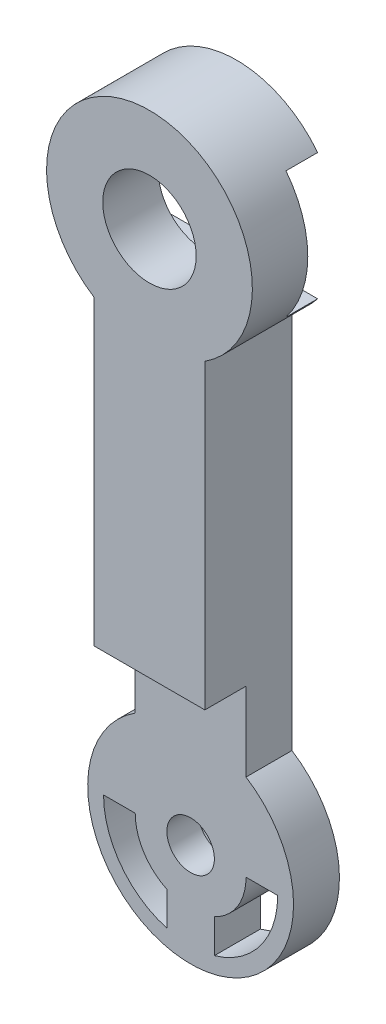
ISO-10303-21;
HEADER;
FILE_DESCRIPTION(('STEP AP214'),'2;1');
FILE_NAME('part.step','',(''),(''),'','','');
FILE_SCHEMA(('AUTOMOTIVE_DESIGN { 1 0 10303 214 1 1 1 1 }'));
ENDSEC;
DATA;
#1=APPLICATION_CONTEXT('core data for automotive mechanical design processes');
#2=APPLICATION_PROTOCOL_DEFINITION('international standard','automotive_design',2000,#1);
#3=PRODUCT_CONTEXT('',#1,'mechanical');
#4=PRODUCT('Part','Part','',(#3));
#5=PRODUCT_RELATED_PRODUCT_CATEGORY('part','',(#4));
#6=PRODUCT_DEFINITION_FORMATION('','',#4);
#7=PRODUCT_DEFINITION_CONTEXT('part definition',#1,'design');
#8=PRODUCT_DEFINITION('design','',#6,#7);
#9=PRODUCT_DEFINITION_SHAPE('','',#8);
#10=(LENGTH_UNIT() NAMED_UNIT(*) SI_UNIT(.MILLI.,.METRE.));
#11=(NAMED_UNIT(*) PLANE_ANGLE_UNIT() SI_UNIT($,.RADIAN.));
#12=(NAMED_UNIT(*) SI_UNIT($,.STERADIAN.) SOLID_ANGLE_UNIT());
#13=UNCERTAINTY_MEASURE_WITH_UNIT(LENGTH_MEASURE(1.E-05),#10,'distance_accuracy_value','');
#14=(GEOMETRIC_REPRESENTATION_CONTEXT(3) GLOBAL_UNCERTAINTY_ASSIGNED_CONTEXT((#13)) GLOBAL_UNIT_ASSIGNED_CONTEXT((#10,
#11,#12)) REPRESENTATION_CONTEXT('',''));
#15=CARTESIAN_POINT('',(0.,0.,0.));
#16=DIRECTION('',(0.,0.,1.));
#17=DIRECTION('',(1.,0.,0.));
#18=AXIS2_PLACEMENT_3D('',#15,#16,#17);
#19=CARTESIAN_POINT('',(0.,0.,3.7));
#20=DIRECTION('',(0.,0.,-1.));
#21=DIRECTION('',(-1.,0.,0.));
#22=AXIS2_PLACEMENT_3D('',#19,#20,#21);
#23=CYLINDRICAL_SURFACE('',#22,2.95);
#24=CARTESIAN_POINT('',(0.,0.,6.1));
#25=DIRECTION('',(0.,0.,1.));
#26=DIRECTION('',(1.,0.,0.));
#27=AXIS2_PLACEMENT_3D('',#24,#25,#26);
#28=CIRCLE('',#27,2.95);
#29=CARTESIAN_POINT('',(2.95,0.,6.1));
#30=VERTEX_POINT('',#29);
#31=EDGE_CURVE('E269',#30,#30,#28,.T.);
#32=ORIENTED_EDGE('',*,*,#31,.T.);
#33=EDGE_LOOP('',(#32));
#34=FACE_BOUND('',#33,.T.);
#35=CARTESIAN_POINT('',(0.,0.,2.6));
#36=DIRECTION('',(0.,0.,-1.));
#37=DIRECTION('',(-1.,0.,0.));
#38=AXIS2_PLACEMENT_3D('',#35,#36,#37);
#39=CIRCLE('',#38,2.95);
#40=CARTESIAN_POINT('',(-2.95,0.,2.6));
#41=VERTEX_POINT('',#40);
#42=EDGE_CURVE('E186',#41,#41,#39,.F.);
#43=ORIENTED_EDGE('',*,*,#42,.F.);
#44=EDGE_LOOP('',(#43));
#45=FACE_BOUND('',#44,.T.);
#46=ADVANCED_FACE('F47',(#34,#45),#23,.F.);
#47=CARTESIAN_POINT('',(0.,0.,0.6));
#48=DIRECTION('',(0.,0.,-1.));
#49=DIRECTION('',(-1.,0.,0.));
#50=AXIS2_PLACEMENT_3D('',#47,#48,#49);
#51=PLANE('',#50);
#52=CARTESIAN_POINT('',(0.,0.,0.6));
#53=DIRECTION('',(0.,0.,-1.));
#54=DIRECTION('',(-1.,0.,0.));
#55=AXIS2_PLACEMENT_3D('',#52,#53,#54);
#56=CIRCLE('',#55,6.5);
#57=CARTESIAN_POINT('',(-5.1234753829798,4.,0.6));
#58=VERTEX_POINT('',#57);
#59=CARTESIAN_POINT('',(5.1234753829798,4.,0.6));
#60=VERTEX_POINT('',#59);
#61=EDGE_CURVE('E231',#58,#60,#56,.T.);
#62=ORIENTED_EDGE('',*,*,#61,.T.);
#63=DIRECTION('',(-1.,0.,0.));
#64=VECTOR('',#63,1.);
#65=CARTESIAN_POINT('',(0.,4.,0.6));
#66=LINE('',#65,#64);
#67=EDGE_CURVE('E198',#60,#58,#66,.T.);
#68=ORIENTED_EDGE('',*,*,#67,.T.);
#69=EDGE_LOOP('',(#62,#68));
#70=FACE_BOUND('',#69,.T.);
#71=ADVANCED_FACE('F420',(#70),#51,.T.);
#72=CARTESIAN_POINT('',(-3.5,0.,3.7));
#73=DIRECTION('',(1.,0.,0.));
#74=DIRECTION('',(0.,1.,0.));
#75=AXIS2_PLACEMENT_3D('',#72,#73,#74);
#76=PLANE('',#75);
#77=DIRECTION('',(0.,1.,0.));
#78=VECTOR('',#77,1.);
#79=CARTESIAN_POINT('',(-3.5,0.,0.6));
#80=LINE('',#79,#78);
#81=CARTESIAN_POINT('',(-3.5,-29.5227744249483,0.6));
#82=VERTEX_POINT('',#81);
#83=CARTESIAN_POINT('',(-3.5,-5.47722557505166,0.6));
#84=VERTEX_POINT('',#83);
#85=EDGE_CURVE('E240',#82,#84,#80,.T.);
#86=ORIENTED_EDGE('',*,*,#85,.F.);
#87=DIRECTION('',(0.,0.,-1.));
#88=VECTOR('',#87,1.);
#89=CARTESIAN_POINT('',(-3.5,-29.5227744249483,3.7));
#90=LINE('',#89,#88);
#91=CARTESIAN_POINT('',(-3.5,-29.5227744249483,3.5));
#92=VERTEX_POINT('',#91);
#93=EDGE_CURVE('E57',#92,#82,#90,.T.);
#94=ORIENTED_EDGE('',*,*,#93,.F.);
#95=DIRECTION('',(0.,-1.,0.));
#96=VECTOR('',#95,1.);
#97=CARTESIAN_POINT('',(-3.5,0.,3.5));
#98=LINE('',#97,#96);
#99=CARTESIAN_POINT('',(-3.5,-24.55,3.5));
#100=VERTEX_POINT('',#99);
#101=EDGE_CURVE('E306',#100,#92,#98,.T.);
#102=ORIENTED_EDGE('',*,*,#101,.F.);
#103=DIRECTION('',(0.,0.,-1.));
#104=VECTOR('',#103,1.);
#105=CARTESIAN_POINT('',(-3.5,-24.55,3.7));
#106=LINE('',#105,#104);
#107=CARTESIAN_POINT('',(-3.5,-24.55,6.1));
#108=VERTEX_POINT('',#107);
#109=EDGE_CURVE('E344',#108,#100,#106,.T.);
#110=ORIENTED_EDGE('',*,*,#109,.F.);
#111=DIRECTION('',(0.,-1.,0.));
#112=VECTOR('',#111,1.);
#113=CARTESIAN_POINT('',(-3.5,-5.47722557505166,6.1));
#114=LINE('',#113,#112);
#115=CARTESIAN_POINT('',(-3.5,-5.47722557505166,6.1));
#116=VERTEX_POINT('',#115);
#117=EDGE_CURVE('E277',#116,#108,#114,.T.);
#118=ORIENTED_EDGE('',*,*,#117,.F.);
#119=DIRECTION('',(0.,0.,-1.));
#120=VECTOR('',#119,1.);
#121=CARTESIAN_POINT('',(-3.5,-5.47722557505166,3.7));
#122=LINE('',#121,#120);
#123=EDGE_CURVE('E11',#116,#84,#122,.T.);
#124=ORIENTED_EDGE('',*,*,#123,.T.);
#125=EDGE_LOOP('',(#86,#94,#102,#110,#118,#124));
#126=FACE_BOUND('',#125,.T.);
#127=ADVANCED_FACE('F426',(#126),#76,.F.);
#128=CARTESIAN_POINT('',(0.,-35.,3.7));
#129=DIRECTION('',(0.,0.,-1.));
#130=DIRECTION('',(-1.,0.,0.));
#131=AXIS2_PLACEMENT_3D('',#128,#129,#130);
#132=CYLINDRICAL_SURFACE('',#131,6.5);
#133=ORIENTED_EDGE('',*,*,#93,.T.);
#134=CARTESIAN_POINT('',(0.,-35.,0.6));
#135=DIRECTION('',(0.,0.,-1.));
#136=DIRECTION('',(-1.,0.,0.));
#137=AXIS2_PLACEMENT_3D('',#134,#135,#136);
#138=CIRCLE('',#137,6.5);
#139=CARTESIAN_POINT('',(3.5,-29.5227744249483,0.6));
#140=VERTEX_POINT('',#139);
#141=EDGE_CURVE('E236',#82,#140,#138,.F.);
#142=ORIENTED_EDGE('',*,*,#141,.T.);
#143=DIRECTION('',(0.,0.,-1.));
#144=VECTOR('',#143,1.);
#145=CARTESIAN_POINT('',(3.5,-29.5227744249483,3.7));
#146=LINE('',#145,#144);
#147=CARTESIAN_POINT('',(3.5,-29.5227744249483,3.5));
#148=VERTEX_POINT('',#147);
#149=EDGE_CURVE('E352',#148,#140,#146,.T.);
#150=ORIENTED_EDGE('',*,*,#149,.F.);
#151=CARTESIAN_POINT('',(0.,-35.,3.5));
#152=DIRECTION('',(0.,0.,1.));
#153=DIRECTION('',(1.,0.,0.));
#154=AXIS2_PLACEMENT_3D('',#151,#152,#153);
#155=CIRCLE('',#154,6.5);
#156=EDGE_CURVE('E311',#92,#148,#155,.T.);
#157=ORIENTED_EDGE('',*,*,#156,.F.);
#158=EDGE_LOOP('',(#133,#142,#150,#157));
#159=FACE_BOUND('',#158,.T.);
#160=ADVANCED_FACE('F473',(#159),#132,.T.);
#161=CARTESIAN_POINT('',(0.,-35.,3.7));
#162=DIRECTION('',(0.,-1.,0.));
#163=DIRECTION('',(0.,0.,-1.));
#164=AXIS2_PLACEMENT_3D('',#161,#162,#163);
#165=PLANE('',#164);
#166=DIRECTION('',(0.,0.,-1.));
#167=VECTOR('',#166,1.);
#168=CARTESIAN_POINT('',(-5.5,-35.,3.7));
#169=LINE('',#168,#167);
#170=CARTESIAN_POINT('',(-5.5,-35.,3.5));
#171=VERTEX_POINT('',#170);
#172=CARTESIAN_POINT('',(-5.5,-35.,0.6));
#173=VERTEX_POINT('',#172);
#174=EDGE_CURVE('E360',#171,#173,#169,.T.);
#175=ORIENTED_EDGE('',*,*,#174,.T.);
#176=DIRECTION('',(1.,0.,0.));
#177=VECTOR('',#176,1.);
#178=CARTESIAN_POINT('',(0.,-35.,0.6));
#179=LINE('',#178,#177);
#180=CARTESIAN_POINT('',(-3.5,-35.,0.6));
#181=VERTEX_POINT('',#180);
#182=EDGE_CURVE('E73',#173,#181,#179,.T.);
#183=ORIENTED_EDGE('',*,*,#182,.T.);
#184=DIRECTION('',(0.,0.,-1.));
#185=VECTOR('',#184,1.);
#186=CARTESIAN_POINT('',(-3.5,-35.,3.7));
#187=LINE('',#186,#185);
#188=CARTESIAN_POINT('',(-3.5,-35.,3.5));
#189=VERTEX_POINT('',#188);
#190=EDGE_CURVE('E353',#189,#181,#187,.T.);
#191=ORIENTED_EDGE('',*,*,#190,.F.);
#192=DIRECTION('',(1.,0.,0.));
#193=VECTOR('',#192,1.);
#194=CARTESIAN_POINT('',(0.,-35.,3.5));
#195=LINE('',#194,#193);
#196=EDGE_CURVE('E323',#171,#189,#195,.T.);
#197=ORIENTED_EDGE('',*,*,#196,.F.);
#198=EDGE_LOOP('',(#175,#183,#191,#197));
#199=FACE_BOUND('',#198,.T.);
#200=ADVANCED_FACE('F431',(#199),#165,.T.);
#201=CARTESIAN_POINT('',(0.,-35.,3.7));
#202=DIRECTION('',(0.,0.,-1.));
#203=DIRECTION('',(-1.,0.,0.));
#204=AXIS2_PLACEMENT_3D('',#201,#202,#203);
#205=CYLINDRICAL_SURFACE('',#204,3.5);
#206=ORIENTED_EDGE('',*,*,#190,.T.);
#207=CARTESIAN_POINT('',(0.,-35.,0.6));
#208=DIRECTION('',(0.,0.,-1.));
#209=DIRECTION('',(-1.,0.,0.));
#210=AXIS2_PLACEMENT_3D('',#207,#208,#209);
#211=CIRCLE('',#210,3.5);
#212=CARTESIAN_POINT('',(-1.5,-38.1622776601684,0.6));
#213=VERTEX_POINT('',#212);
#214=EDGE_CURVE('E263',#181,#213,#211,.F.);
#215=ORIENTED_EDGE('',*,*,#214,.T.);
#216=DIRECTION('',(0.,0.,-1.));
#217=VECTOR('',#216,1.);
#218=CARTESIAN_POINT('',(-1.5,-38.1622776601684,3.7));
#219=LINE('',#218,#217);
#220=CARTESIAN_POINT('',(-1.5,-38.1622776601684,3.5));
#221=VERTEX_POINT('',#220);
#222=EDGE_CURVE('E369',#221,#213,#219,.T.);
#223=ORIENTED_EDGE('',*,*,#222,.F.);
#224=CARTESIAN_POINT('',(0.,-35.,3.5));
#225=DIRECTION('',(0.,0.,1.));
#226=DIRECTION('',(1.,0.,0.));
#227=AXIS2_PLACEMENT_3D('',#224,#225,#226);
#228=CIRCLE('',#227,3.5);
#229=EDGE_CURVE('E298',#189,#221,#228,.T.);
#230=ORIENTED_EDGE('',*,*,#229,.F.);
#231=EDGE_LOOP('',(#206,#215,#223,#230));
#232=FACE_BOUND('',#231,.T.);
#233=ADVANCED_FACE('F461',(#232),#205,.T.);
#234=CARTESIAN_POINT('',(-1.5,0.,3.7));
#235=DIRECTION('',(1.,0.,0.));
#236=DIRECTION('',(0.,0.,-1.));
#237=AXIS2_PLACEMENT_3D('',#234,#235,#236);
#238=PLANE('',#237);
#239=DIRECTION('',(0.,1.,0.));
#240=VECTOR('',#239,1.);
#241=CARTESIAN_POINT('',(-1.5,0.,0.6));
#242=LINE('',#241,#240);
#243=CARTESIAN_POINT('',(-1.5,-40.2915026221292,0.6));
#244=VERTEX_POINT('',#243);
#245=EDGE_CURVE('E260',#244,#213,#242,.T.);
#246=ORIENTED_EDGE('',*,*,#245,.F.);
#247=DIRECTION('',(0.,0.,-1.));
#248=VECTOR('',#247,1.);
#249=CARTESIAN_POINT('',(-1.5,-40.2915026221292,3.7));
#250=LINE('',#249,#248);
#251=CARTESIAN_POINT('',(-1.5,-40.2915026221292,3.5));
#252=VERTEX_POINT('',#251);
#253=EDGE_CURVE('E364',#252,#244,#250,.T.);
#254=ORIENTED_EDGE('',*,*,#253,.F.);
#255=DIRECTION('',(0.,-1.,0.));
#256=VECTOR('',#255,1.);
#257=CARTESIAN_POINT('',(-1.5,0.,3.5));
#258=LINE('',#257,#256);
#259=EDGE_CURVE('E327',#221,#252,#258,.T.);
#260=ORIENTED_EDGE('',*,*,#259,.F.);
#261=ORIENTED_EDGE('',*,*,#222,.T.);
#262=EDGE_LOOP('',(#246,#254,#260,#261));
#263=FACE_BOUND('',#262,.T.);
#264=ADVANCED_FACE('F460',(#263),#238,.F.);
#265=DIRECTION('',(0.,0.,-1.));
#266=VECTOR('',#265,1.);
#267=CARTESIAN_POINT('',(1.5,-38.1622776601684,3.7));
#268=LINE('',#267,#266);
#269=CARTESIAN_POINT('',(1.5,-38.1622776601684,3.5));
#270=VERTEX_POINT('',#269);
#271=CARTESIAN_POINT('',(1.5,-38.1622776601684,0.6));
#272=VERTEX_POINT('',#271);
#273=EDGE_CURVE('E347',#270,#272,#268,.T.);
#274=ORIENTED_EDGE('',*,*,#273,.T.);
#275=CARTESIAN_POINT('',(0.,-35.,0.6));
#276=DIRECTION('',(0.,0.,-1.));
#277=DIRECTION('',(-1.,0.,0.));
#278=AXIS2_PLACEMENT_3D('',#275,#276,#277);
#279=CIRCLE('',#278,3.5);
#280=CARTESIAN_POINT('',(3.5,-35.,0.6));
#281=VERTEX_POINT('',#280);
#282=EDGE_CURVE('E253',#272,#281,#279,.F.);
#283=ORIENTED_EDGE('',*,*,#282,.T.);
#284=DIRECTION('',(0.,0.,-1.));
#285=VECTOR('',#284,1.);
#286=CARTESIAN_POINT('',(3.5,-35.,3.7));
#287=LINE('',#286,#285);
#288=CARTESIAN_POINT('',(3.5,-35.,3.5));
#289=VERTEX_POINT('',#288);
#290=EDGE_CURVE('E365',#289,#281,#287,.T.);
#291=ORIENTED_EDGE('',*,*,#290,.F.);
#292=EDGE_CURVE('E293',#270,#289,#228,.T.);
#293=ORIENTED_EDGE('',*,*,#292,.F.);
#294=EDGE_LOOP('',(#274,#283,#291,#293));
#295=FACE_BOUND('',#294,.T.);
#296=ADVANCED_FACE('F458',(#295),#205,.T.);
#297=CARTESIAN_POINT('',(0.,-35.,3.7));
#298=DIRECTION('',(0.,1.,0.));
#299=DIRECTION('',(0.,0.,1.));
#300=AXIS2_PLACEMENT_3D('',#297,#298,#299);
#301=PLANE('',#300);
#302=DIRECTION('',(-1.,0.,0.));
#303=VECTOR('',#302,1.);
#304=CARTESIAN_POINT('',(0.,-35.,0.6));
#305=LINE('',#304,#303);
#306=CARTESIAN_POINT('',(5.5,-35.,0.6));
#307=VERTEX_POINT('',#306);
#308=EDGE_CURVE('E250',#307,#281,#305,.T.);
#309=ORIENTED_EDGE('',*,*,#308,.F.);
#310=DIRECTION('',(0.,0.,-1.));
#311=VECTOR('',#310,1.);
#312=CARTESIAN_POINT('',(5.5,-35.,3.7));
#313=LINE('',#312,#311);
#314=CARTESIAN_POINT('',(5.5,-35.,3.5));
#315=VERTEX_POINT('',#314);
#316=EDGE_CURVE('E383',#315,#307,#313,.T.);
#317=ORIENTED_EDGE('',*,*,#316,.F.);
#318=DIRECTION('',(1.,0.,0.));
#319=VECTOR('',#318,1.);
#320=CARTESIAN_POINT('',(0.,-35.,3.5));
#321=LINE('',#320,#319);
#322=EDGE_CURVE('E297',#289,#315,#321,.T.);
#323=ORIENTED_EDGE('',*,*,#322,.F.);
#324=ORIENTED_EDGE('',*,*,#290,.T.);
#325=EDGE_LOOP('',(#309,#317,#323,#324));
#326=FACE_BOUND('',#325,.T.);
#327=ADVANCED_FACE('F49',(#326),#301,.F.);
#328=CARTESIAN_POINT('',(0.,-35.,3.7));
#329=DIRECTION('',(0.,0.,-1.));
#330=DIRECTION('',(-1.,0.,0.));
#331=AXIS2_PLACEMENT_3D('',#328,#329,#330);
#332=CYLINDRICAL_SURFACE('',#331,5.5);
#333=CARTESIAN_POINT('',(0.,-35.,0.6));
#334=DIRECTION('',(0.,0.,-1.));
#335=DIRECTION('',(-1.,0.,0.));
#336=AXIS2_PLACEMENT_3D('',#333,#334,#335);
#337=CIRCLE('',#336,5.5);
#338=CARTESIAN_POINT('',(1.5,-40.2915026221292,0.6));
#339=VERTEX_POINT('',#338);
#340=EDGE_CURVE('E247',#339,#307,#337,.F.);
#341=ORIENTED_EDGE('',*,*,#340,.F.);
#342=DIRECTION('',(0.,0.,-1.));
#343=VECTOR('',#342,1.);
#344=CARTESIAN_POINT('',(1.5,-40.2915026221292,3.7));
#345=LINE('',#344,#343);
#346=CARTESIAN_POINT('',(1.5,-40.2915026221292,3.5));
#347=VERTEX_POINT('',#346);
#348=EDGE_CURVE('E379',#347,#339,#345,.T.);
#349=ORIENTED_EDGE('',*,*,#348,.F.);
#350=CARTESIAN_POINT('',(0.,-35.,3.5));
#351=DIRECTION('',(0.,0.,1.));
#352=DIRECTION('',(1.,0.,0.));
#353=AXIS2_PLACEMENT_3D('',#350,#351,#352);
#354=CIRCLE('',#353,5.5);
#355=EDGE_CURVE('E302',#347,#315,#354,.T.);
#356=ORIENTED_EDGE('',*,*,#355,.T.);
#357=ORIENTED_EDGE('',*,*,#316,.T.);
#358=EDGE_LOOP('',(#341,#349,#356,#357));
#359=FACE_BOUND('',#358,.T.);
#360=ADVANCED_FACE('F446',(#359),#332,.F.);
#361=CARTESIAN_POINT('',(3.5,0.,3.7));
#362=DIRECTION('',(1.,0.,0.));
#363=DIRECTION('',(0.,1.,0.));
#364=AXIS2_PLACEMENT_3D('',#361,#362,#363);
#365=PLANE('',#364);
#366=ORIENTED_EDGE('',*,*,#149,.T.);
#367=DIRECTION('',(0.,1.,0.));
#368=VECTOR('',#367,1.);
#369=CARTESIAN_POINT('',(3.5,0.,0.6));
#370=LINE('',#369,#368);
#371=CARTESIAN_POINT('',(3.5,-5.47722557505166,0.6));
#372=VERTEX_POINT('',#371);
#373=EDGE_CURVE('E230',#140,#372,#370,.T.);
#374=ORIENTED_EDGE('',*,*,#373,.T.);
#375=DIRECTION('',(0.,0.,-1.));
#376=VECTOR('',#375,1.);
#377=CARTESIAN_POINT('',(3.5,-5.47722557505166,3.7));
#378=LINE('',#377,#376);
#379=CARTESIAN_POINT('',(3.5,-5.47722557505166,6.1));
#380=VERTEX_POINT('',#379);
#381=EDGE_CURVE('E348',#380,#372,#378,.T.);
#382=ORIENTED_EDGE('',*,*,#381,.F.);
#383=DIRECTION('',(0.,1.,0.));
#384=VECTOR('',#383,1.);
#385=CARTESIAN_POINT('',(3.5,-5.47722557505166,6.1));
#386=LINE('',#385,#384);
#387=CARTESIAN_POINT('',(3.5,-24.55,6.1));
#388=VERTEX_POINT('',#387);
#389=EDGE_CURVE('E285',#388,#380,#386,.T.);
#390=ORIENTED_EDGE('',*,*,#389,.F.);
#391=DIRECTION('',(0.,0.,-1.));
#392=VECTOR('',#391,1.);
#393=CARTESIAN_POINT('',(3.5,-24.55,3.7));
#394=LINE('',#393,#392);
#395=CARTESIAN_POINT('',(3.5,-24.55,3.5));
#396=VERTEX_POINT('',#395);
#397=EDGE_CURVE('E340',#388,#396,#394,.T.);
#398=ORIENTED_EDGE('',*,*,#397,.T.);
#399=DIRECTION('',(0.,1.,0.));
#400=VECTOR('',#399,1.);
#401=CARTESIAN_POINT('',(3.5,0.,3.5));
#402=LINE('',#401,#400);
#403=EDGE_CURVE('E315',#148,#396,#402,.T.);
#404=ORIENTED_EDGE('',*,*,#403,.F.);
#405=EDGE_LOOP('',(#366,#374,#382,#390,#398,#404));
#406=FACE_BOUND('',#405,.T.);
#407=ADVANCED_FACE('F443',(#406),#365,.T.);
#408=CARTESIAN_POINT('',(0.,-35.,0.6));
#409=DIRECTION('',(0.,0.,-1.));
#410=DIRECTION('',(-1.,0.,0.));
#411=AXIS2_PLACEMENT_3D('',#408,#409,#410);
#412=CIRCLE('',#411,5.5);
#413=EDGE_CURVE('E257',#173,#244,#412,.F.);
#414=ORIENTED_EDGE('',*,*,#413,.F.);
#415=ORIENTED_EDGE('',*,*,#174,.F.);
#416=EDGE_CURVE('E307',#171,#252,#354,.T.);
#417=ORIENTED_EDGE('',*,*,#416,.T.);
#418=ORIENTED_EDGE('',*,*,#253,.T.);
#419=EDGE_LOOP('',(#414,#415,#417,#418));
#420=FACE_BOUND('',#419,.T.);
#421=ADVANCED_FACE('F435',(#420),#332,.F.);
#422=CARTESIAN_POINT('',(1.5,0.,3.7));
#423=DIRECTION('',(1.,0.,0.));
#424=DIRECTION('',(0.,0.,-1.));
#425=AXIS2_PLACEMENT_3D('',#422,#423,#424);
#426=PLANE('',#425);
#427=ORIENTED_EDGE('',*,*,#348,.T.);
#428=DIRECTION('',(0.,1.,0.));
#429=VECTOR('',#428,1.);
#430=CARTESIAN_POINT('',(1.5,0.,0.6));
#431=LINE('',#430,#429);
#432=EDGE_CURVE('E243',#339,#272,#431,.T.);
#433=ORIENTED_EDGE('',*,*,#432,.T.);
#434=ORIENTED_EDGE('',*,*,#273,.F.);
#435=DIRECTION('',(0.,1.,0.));
#436=VECTOR('',#435,1.);
#437=CARTESIAN_POINT('',(1.5,0.,3.5));
#438=LINE('',#437,#436);
#439=EDGE_CURVE('E289',#347,#270,#438,.T.);
#440=ORIENTED_EDGE('',*,*,#439,.F.);
#441=EDGE_LOOP('',(#427,#433,#434,#440));
#442=FACE_BOUND('',#441,.T.);
#443=ADVANCED_FACE('F433',(#442),#426,.T.);
#444=CARTESIAN_POINT('',(0.,0.,3.7));
#445=DIRECTION('',(0.,0.,-1.));
#446=DIRECTION('',(-1.,0.,0.));
#447=AXIS2_PLACEMENT_3D('',#444,#445,#446);
#448=CYLINDRICAL_SURFACE('',#447,6.5);
#449=CARTESIAN_POINT('',(5.1234753829798,-4.,0.6));
#450=VERTEX_POINT('',#449);
#451=EDGE_CURVE('E232',#450,#372,#56,.T.);
#452=ORIENTED_EDGE('',*,*,#451,.F.);
#453=DIRECTION('',(0.,0.,-1.));
#454=VECTOR('',#453,1.);
#455=CARTESIAN_POINT('',(5.1234753829798,-4.,2.6));
#456=LINE('',#455,#454);
#457=CARTESIAN_POINT('',(5.1234753829798,-4.,2.6));
#458=VERTEX_POINT('',#457);
#459=EDGE_CURVE('E218',#458,#450,#456,.T.);
#460=ORIENTED_EDGE('',*,*,#459,.F.);
#461=CARTESIAN_POINT('',(0.,0.,2.6));
#462=DIRECTION('',(0.,0.,-1.));
#463=DIRECTION('',(-1.,0.,0.));
#464=AXIS2_PLACEMENT_3D('',#461,#462,#463);
#465=CIRCLE('',#464,6.5);
#466=CARTESIAN_POINT('',(5.1234753829798,4.,2.6));
#467=VERTEX_POINT('',#466);
#468=EDGE_CURVE('E195',#467,#458,#465,.T.);
#469=ORIENTED_EDGE('',*,*,#468,.F.);
#470=DIRECTION('',(0.,0.,-1.));
#471=VECTOR('',#470,1.);
#472=CARTESIAN_POINT('',(5.1234753829798,4.,2.6));
#473=LINE('',#472,#471);
#474=EDGE_CURVE('E221',#467,#60,#473,.T.);
#475=ORIENTED_EDGE('',*,*,#474,.T.);
#476=ORIENTED_EDGE('',*,*,#61,.F.);
#477=DIRECTION('',(0.,0.,-1.));
#478=VECTOR('',#477,1.);
#479=CARTESIAN_POINT('',(-5.1234753829798,4.,2.6));
#480=LINE('',#479,#478);
#481=CARTESIAN_POINT('',(-5.1234753829798,4.,2.6));
#482=VERTEX_POINT('',#481);
#483=EDGE_CURVE('E65',#482,#58,#480,.T.);
#484=ORIENTED_EDGE('',*,*,#483,.F.);
#485=CARTESIAN_POINT('',(0.,0.,2.6));
#486=DIRECTION('',(0.,0.,-1.));
#487=DIRECTION('',(-1.,0.,0.));
#488=AXIS2_PLACEMENT_3D('',#485,#486,#487);
#489=CIRCLE('',#488,6.5);
#490=CARTESIAN_POINT('',(-5.1234753829798,-4.,2.6));
#491=VERTEX_POINT('',#490);
#492=EDGE_CURVE('E193',#491,#482,#489,.T.);
#493=ORIENTED_EDGE('',*,*,#492,.F.);
#494=DIRECTION('',(0.,0.,-1.));
#495=VECTOR('',#494,1.);
#496=CARTESIAN_POINT('',(-5.1234753829798,-4.,2.6));
#497=LINE('',#496,#495);
#498=CARTESIAN_POINT('',(-5.1234753829798,-4.,0.6));
#499=VERTEX_POINT('',#498);
#500=EDGE_CURVE('E174',#491,#499,#497,.T.);
#501=ORIENTED_EDGE('',*,*,#500,.T.);
#502=EDGE_CURVE('E227',#84,#499,#56,.T.);
#503=ORIENTED_EDGE('',*,*,#502,.F.);
#504=ORIENTED_EDGE('',*,*,#123,.F.);
#505=CARTESIAN_POINT('',(0.,0.,6.1));
#506=DIRECTION('',(0.,0.,1.));
#507=DIRECTION('',(1.,0.,0.));
#508=AXIS2_PLACEMENT_3D('',#505,#506,#507);
#509=CIRCLE('',#508,6.5);
#510=EDGE_CURVE('E273',#380,#116,#509,.T.);
#511=ORIENTED_EDGE('',*,*,#510,.F.);
#512=ORIENTED_EDGE('',*,*,#381,.T.);
#513=EDGE_LOOP('',(#452,#460,#469,#475,#476,#484,#493,#501,#503,#504,#511,#512));
#514=FACE_BOUND('',#513,.T.);
#515=ADVANCED_FACE('F201',(#514),#448,.T.);
#516=CARTESIAN_POINT('',(0.,-35.,1.5));
#517=DIRECTION('',(0.,0.,-1.));
#518=DIRECTION('',(-1.,0.,0.));
#519=AXIS2_PLACEMENT_3D('',#516,#517,#518);
#520=CYLINDRICAL_SURFACE('',#519,2.5);
#521=CARTESIAN_POINT('',(0.,-35.,1.5));
#522=DIRECTION('',(0.,0.,-1.));
#523=DIRECTION('',(-1.,0.,0.));
#524=AXIS2_PLACEMENT_3D('',#521,#522,#523);
#525=CIRCLE('',#524,2.5);
#526=CARTESIAN_POINT('',(-2.5,-35.,1.5));
#527=VERTEX_POINT('',#526);
#528=EDGE_CURVE('E335',#527,#527,#525,.T.);
#529=ORIENTED_EDGE('',*,*,#528,.F.);
#530=EDGE_LOOP('',(#529));
#531=FACE_BOUND('',#530,.T.);
#532=CARTESIAN_POINT('',(0.,-35.,0.6));
#533=DIRECTION('',(0.,0.,-1.));
#534=DIRECTION('',(-1.,0.,0.));
#535=AXIS2_PLACEMENT_3D('',#532,#533,#534);
#536=CIRCLE('',#535,2.5);
#537=CARTESIAN_POINT('',(-2.5,-35.,0.6));
#538=VERTEX_POINT('',#537);
#539=EDGE_CURVE('E51',#538,#538,#536,.F.);
#540=ORIENTED_EDGE('',*,*,#539,.F.);
#541=EDGE_LOOP('',(#540));
#542=FACE_BOUND('',#541,.T.);
#543=ADVANCED_FACE('F399',(#531,#542),#520,.F.);
#544=CARTESIAN_POINT('',(0.,-35.,3.1));
#545=DIRECTION('',(0.,0.,-1.));
#546=DIRECTION('',(-1.,0.,0.));
#547=AXIS2_PLACEMENT_3D('',#544,#545,#546);
#548=CYLINDRICAL_SURFACE('',#547,1.5);
#549=CARTESIAN_POINT('',(0.,-35.,1.5));
#550=DIRECTION('',(0.,0.,-1.));
#551=DIRECTION('',(-1.,0.,0.));
#552=AXIS2_PLACEMENT_3D('',#549,#550,#551);
#553=CIRCLE('',#552,1.5);
#554=CARTESIAN_POINT('',(-1.5,-35.,1.5));
#555=VERTEX_POINT('',#554);
#556=EDGE_CURVE('E339',#555,#555,#553,.F.);
#557=CARTESIAN_POINT('',(0.,-35.,3.5));
#558=DIRECTION('',(0.,0.,1.));
#559=DIRECTION('',(1.,0.,0.));
#560=AXIS2_PLACEMENT_3D('',#557,#558,#559);
#561=CIRCLE('',#560,1.5);
#562=CARTESIAN_POINT('',(-1.5,-35.,3.5));
#563=VERTEX_POINT('',#562);
#564=EDGE_CURVE('E331',#563,#563,#561,.F.);
#565=CARTESIAN_POINT('',(-1.5,-35.,1.5));
#566=CARTESIAN_POINT('',(-1.5,-35.,1.52083333333333));
#567=CARTESIAN_POINT('',(-1.5,-35.,1.54166666666667));
#568=CARTESIAN_POINT('',(-1.5,-35.,1.58333333333333));
#569=CARTESIAN_POINT('',(-1.5,-35.,1.60416666666667));
#570=CARTESIAN_POINT('',(-1.5,-35.,1.64583333333333));
#571=CARTESIAN_POINT('',(-1.5,-35.,1.66666666666667));
#572=CARTESIAN_POINT('',(-1.5,-35.,1.70833333333333));
#573=CARTESIAN_POINT('',(-1.5,-35.,1.72916666666667));
#574=CARTESIAN_POINT('',(-1.5,-35.,1.77083333333333));
#575=CARTESIAN_POINT('',(-1.5,-35.,1.79166666666667));
#576=CARTESIAN_POINT('',(-1.5,-35.,1.83333333333333));
#577=CARTESIAN_POINT('',(-1.5,-35.,1.85416666666667));
#578=CARTESIAN_POINT('',(-1.5,-35.,1.89583333333333));
#579=CARTESIAN_POINT('',(-1.5,-35.,1.91666666666667));
#580=CARTESIAN_POINT('',(-1.5,-35.,1.95833333333333));
#581=CARTESIAN_POINT('',(-1.5,-35.,1.97916666666667));
#582=CARTESIAN_POINT('',(-1.5,-35.,2.02083333333333));
#583=CARTESIAN_POINT('',(-1.5,-35.,2.04166666666667));
#584=CARTESIAN_POINT('',(-1.5,-35.,2.08333333333333));
#585=CARTESIAN_POINT('',(-1.5,-35.,2.10416666666667));
#586=CARTESIAN_POINT('',(-1.5,-35.,2.14583333333333));
#587=CARTESIAN_POINT('',(-1.5,-35.,2.16666666666667));
#588=CARTESIAN_POINT('',(-1.5,-35.,2.20833333333333));
#589=CARTESIAN_POINT('',(-1.5,-35.,2.22916666666667));
#590=CARTESIAN_POINT('',(-1.5,-35.,2.27083333333333));
#591=CARTESIAN_POINT('',(-1.5,-35.,2.29166666666667));
#592=CARTESIAN_POINT('',(-1.5,-35.,2.33333333333333));
#593=CARTESIAN_POINT('',(-1.5,-35.,2.35416666666667));
#594=CARTESIAN_POINT('',(-1.5,-35.,2.39583333333333));
#595=CARTESIAN_POINT('',(-1.5,-35.,2.41666666666667));
#596=CARTESIAN_POINT('',(-1.5,-35.,2.45833333333333));
#597=CARTESIAN_POINT('',(-1.5,-35.,2.47916666666667));
#598=CARTESIAN_POINT('',(-1.5,-35.,2.52083333333333));
#599=CARTESIAN_POINT('',(-1.5,-35.,2.54166666666667));
#600=CARTESIAN_POINT('',(-1.5,-35.,2.58333333333334));
#601=CARTESIAN_POINT('',(-1.5,-35.,2.60416666666667));
#602=CARTESIAN_POINT('',(-1.5,-35.,2.64583333333334));
#603=CARTESIAN_POINT('',(-1.5,-35.,2.66666666666667));
#604=CARTESIAN_POINT('',(-1.5,-35.,2.70833333333334));
#605=CARTESIAN_POINT('',(-1.5,-35.,2.72916666666667));
#606=CARTESIAN_POINT('',(-1.5,-35.,2.77083333333334));
#607=CARTESIAN_POINT('',(-1.5,-35.,2.79166666666667));
#608=CARTESIAN_POINT('',(-1.5,-35.,2.83333333333334));
#609=CARTESIAN_POINT('',(-1.5,-35.,2.85416666666667));
#610=CARTESIAN_POINT('',(-1.5,-35.,2.89583333333334));
#611=CARTESIAN_POINT('',(-1.5,-35.,2.91666666666667));
#612=CARTESIAN_POINT('',(-1.5,-35.,2.95833333333334));
#613=CARTESIAN_POINT('',(-1.5,-35.,2.97916666666667));
#614=CARTESIAN_POINT('',(-1.5,-35.,3.02083333333334));
#615=CARTESIAN_POINT('',(-1.5,-35.,3.04166666666667));
#616=CARTESIAN_POINT('',(-1.5,-35.,3.08333333333334));
#617=CARTESIAN_POINT('',(-1.5,-35.,3.10416666666667));
#618=CARTESIAN_POINT('',(-1.5,-35.,3.14583333333334));
#619=CARTESIAN_POINT('',(-1.5,-35.,3.16666666666667));
#620=CARTESIAN_POINT('',(-1.5,-35.,3.20833333333334));
#621=CARTESIAN_POINT('',(-1.5,-35.,3.22916666666667));
#622=CARTESIAN_POINT('',(-1.5,-35.,3.27083333333334));
#623=CARTESIAN_POINT('',(-1.5,-35.,3.29166666666667));
#624=CARTESIAN_POINT('',(-1.5,-35.,3.33333333333334));
#625=CARTESIAN_POINT('',(-1.5,-35.,3.35416666666667));
#626=CARTESIAN_POINT('',(-1.5,-35.,3.39583333333334));
#627=CARTESIAN_POINT('',(-1.5,-35.,3.41666666666667));
#628=CARTESIAN_POINT('',(-1.5,-35.,3.45833333333334));
#629=CARTESIAN_POINT('',(-1.5,-35.,3.47916666666667));
#630=CARTESIAN_POINT('',(-1.5,-35.,3.5));
#631=B_SPLINE_CURVE_WITH_KNOTS('',3,(#565,#566,#567,#568,#569,#570,#571,#572,#573,#574,#575,
#576,#577,#578,#579,#580,#581,#582,#583,#584,#585,#586,#587,#588,#589,#590,#591,#592,#593,#594,
#595,#596,#597,#598,#599,#600,#601,#602,#603,#604,#605,#606,#607,#608,#609,#610,#611,#612,#613,
#614,#615,#616,#617,#618,#619,#620,#621,#622,#623,#624,#625,#626,#627,#628,#629,#630),
.UNSPECIFIED.,.F.,.F.,(4,2,2,2,2,2,2,2,2,2,2,2,2,2,2,2,2,2,2,2,2,2,2,2,2,2,2,2,2,2,2,2,4),(0.,
0.0625000000000001,0.125,0.1875,0.25,0.3125,0.375000000000001,0.437500000000001,
0.500000000000001,0.562500000000001,0.625000000000001,0.687500000000001,0.750000000000001,
0.812500000000001,0.875000000000001,0.937500000000001,1.,1.0625,1.125,1.1875,1.25,1.3125,1.375,
1.4375,1.5,1.5625,1.625,1.6875,1.75,1.8125,1.875,1.9375,2.),.UNSPECIFIED.);
#632=EDGE_CURVE('BSEAM395',#555,#563,#631,.T.);
#633=ORIENTED_EDGE('',*,*,#556,.F.);
#634=ORIENTED_EDGE('',*,*,#564,.F.);
#635=ORIENTED_EDGE('',*,*,#632,.T.);
#636=ORIENTED_EDGE('',*,*,#632,.F.);
#637=EDGE_LOOP('',(#633,#635,#634,#636));
#638=FACE_BOUND('',#637,.T.);
#639=ADVANCED_FACE('F395',(#638),#548,.F.);
#640=CARTESIAN_POINT('',(10.,-24.55,3.7));
#641=DIRECTION('',(0.,-1.,0.));
#642=DIRECTION('',(0.,0.,-1.));
#643=AXIS2_PLACEMENT_3D('',#640,#641,#642);
#644=PLANE('',#643);
#645=DIRECTION('',(-1.,0.,0.));
#646=VECTOR('',#645,1.);
#647=CARTESIAN_POINT('',(0.,-24.55,3.5));
#648=LINE('',#647,#646);
#649=EDGE_CURVE('E319',#396,#100,#648,.T.);
#650=ORIENTED_EDGE('',*,*,#649,.F.);
#651=ORIENTED_EDGE('',*,*,#397,.F.);
#652=DIRECTION('',(1.,0.,0.));
#653=VECTOR('',#652,1.);
#654=CARTESIAN_POINT('',(-3.5,-24.55,6.1));
#655=LINE('',#654,#653);
#656=EDGE_CURVE('E281',#108,#388,#655,.T.);
#657=ORIENTED_EDGE('',*,*,#656,.F.);
#658=ORIENTED_EDGE('',*,*,#109,.T.);
#659=EDGE_LOOP('',(#650,#651,#657,#658));
#660=FACE_BOUND('',#659,.T.);
#661=ADVANCED_FACE('F398',(#660),#644,.T.);
#662=CARTESIAN_POINT('',(0.,-35.,1.5));
#663=DIRECTION('',(0.,0.,-1.));
#664=DIRECTION('',(-1.,0.,0.));
#665=AXIS2_PLACEMENT_3D('',#662,#663,#664);
#666=PLANE('',#665);
#667=ORIENTED_EDGE('',*,*,#528,.T.);
#668=EDGE_LOOP('',(#667));
#669=FACE_BOUND('',#668,.T.);
#670=ORIENTED_EDGE('',*,*,#556,.T.);
#671=EDGE_LOOP('',(#670));
#672=FACE_BOUND('',#671,.T.);
#673=ADVANCED_FACE('F393',(#669,#672),#666,.T.);
#674=CARTESIAN_POINT('',(0.,0.,3.5));
#675=DIRECTION('',(0.,0.,1.));
#676=DIRECTION('',(1.,0.,0.));
#677=AXIS2_PLACEMENT_3D('',#674,#675,#676);
#678=PLANE('',#677);
#679=ORIENTED_EDGE('',*,*,#439,.T.);
#680=ORIENTED_EDGE('',*,*,#292,.T.);
#681=ORIENTED_EDGE('',*,*,#322,.T.);
#682=ORIENTED_EDGE('',*,*,#355,.F.);
#683=EDGE_LOOP('',(#679,#680,#681,#682));
#684=FACE_BOUND('',#683,.T.);
#685=ORIENTED_EDGE('',*,*,#101,.T.);
#686=ORIENTED_EDGE('',*,*,#156,.T.);
#687=ORIENTED_EDGE('',*,*,#403,.T.);
#688=ORIENTED_EDGE('',*,*,#649,.T.);
#689=EDGE_LOOP('',(#685,#686,#687,#688));
#690=FACE_BOUND('',#689,.T.);
#691=ORIENTED_EDGE('',*,*,#416,.F.);
#692=ORIENTED_EDGE('',*,*,#196,.T.);
#693=ORIENTED_EDGE('',*,*,#229,.T.);
#694=ORIENTED_EDGE('',*,*,#259,.T.);
#695=EDGE_LOOP('',(#691,#692,#693,#694));
#696=FACE_BOUND('',#695,.T.);
#697=ORIENTED_EDGE('',*,*,#564,.T.);
#698=EDGE_LOOP('',(#697));
#699=FACE_BOUND('',#698,.T.);
#700=ADVANCED_FACE('F403',(#684,#690,#696,#699),#678,.T.);
#701=CARTESIAN_POINT('',(0.,0.,6.1));
#702=DIRECTION('',(0.,0.,1.));
#703=DIRECTION('',(1.,0.,0.));
#704=AXIS2_PLACEMENT_3D('',#701,#702,#703);
#705=PLANE('',#704);
#706=ORIENTED_EDGE('',*,*,#510,.T.);
#707=ORIENTED_EDGE('',*,*,#117,.T.);
#708=ORIENTED_EDGE('',*,*,#656,.T.);
#709=ORIENTED_EDGE('',*,*,#389,.T.);
#710=EDGE_LOOP('',(#706,#707,#708,#709));
#711=FACE_BOUND('',#710,.T.);
#712=ORIENTED_EDGE('',*,*,#31,.F.);
#713=EDGE_LOOP('',(#712));
#714=FACE_BOUND('',#713,.T.);
#715=ADVANCED_FACE('F405',(#711,#714),#705,.T.);
#716=DIRECTION('',(-1.,0.,0.));
#717=VECTOR('',#716,1.);
#718=CARTESIAN_POINT('',(0.,-4.,0.6));
#719=LINE('',#718,#717);
#720=EDGE_CURVE('E180',#450,#499,#719,.T.);
#721=ORIENTED_EDGE('',*,*,#720,.F.);
#722=ORIENTED_EDGE('',*,*,#451,.T.);
#723=ORIENTED_EDGE('',*,*,#373,.F.);
#724=ORIENTED_EDGE('',*,*,#141,.F.);
#725=ORIENTED_EDGE('',*,*,#85,.T.);
#726=ORIENTED_EDGE('',*,*,#502,.T.);
#727=EDGE_LOOP('',(#721,#722,#723,#724,#725,#726));
#728=FACE_BOUND('',#727,.T.);
#729=ORIENTED_EDGE('',*,*,#413,.T.);
#730=ORIENTED_EDGE('',*,*,#245,.T.);
#731=ORIENTED_EDGE('',*,*,#214,.F.);
#732=ORIENTED_EDGE('',*,*,#182,.F.);
#733=EDGE_LOOP('',(#729,#730,#731,#732));
#734=FACE_BOUND('',#733,.T.);
#735=ORIENTED_EDGE('',*,*,#432,.F.);
#736=ORIENTED_EDGE('',*,*,#340,.T.);
#737=ORIENTED_EDGE('',*,*,#308,.T.);
#738=ORIENTED_EDGE('',*,*,#282,.F.);
#739=EDGE_LOOP('',(#735,#736,#737,#738));
#740=FACE_BOUND('',#739,.T.);
#741=ORIENTED_EDGE('',*,*,#539,.T.);
#742=EDGE_LOOP('',(#741));
#743=FACE_BOUND('',#742,.T.);
#744=ADVANCED_FACE('F412',(#728,#734,#740,#743),#51,.T.);
#745=CARTESIAN_POINT('',(0.,-4.,2.6));
#746=DIRECTION('',(0.,-1.,0.));
#747=DIRECTION('',(1.,0.,0.));
#748=AXIS2_PLACEMENT_3D('',#745,#746,#747);
#749=PLANE('',#748);
#750=ORIENTED_EDGE('',*,*,#720,.T.);
#751=ORIENTED_EDGE('',*,*,#500,.F.);
#752=DIRECTION('',(-1.,0.,0.));
#753=VECTOR('',#752,1.);
#754=CARTESIAN_POINT('',(0.,-4.,2.6));
#755=LINE('',#754,#753);
#756=EDGE_CURVE('E177',#458,#491,#755,.T.);
#757=ORIENTED_EDGE('',*,*,#756,.F.);
#758=ORIENTED_EDGE('',*,*,#459,.T.);
#759=EDGE_LOOP('',(#750,#751,#757,#758));
#760=FACE_BOUND('',#759,.T.);
#761=ADVANCED_FACE('F176',(#760),#749,.F.);
#762=CARTESIAN_POINT('',(0.,4.,2.6));
#763=DIRECTION('',(0.,-1.,0.));
#764=DIRECTION('',(1.,0.,0.));
#765=AXIS2_PLACEMENT_3D('',#762,#763,#764);
#766=PLANE('',#765);
#767=ORIENTED_EDGE('',*,*,#67,.F.);
#768=ORIENTED_EDGE('',*,*,#474,.F.);
#769=DIRECTION('',(-1.,0.,0.));
#770=VECTOR('',#769,1.);
#771=CARTESIAN_POINT('',(0.,4.,2.6));
#772=LINE('',#771,#770);
#773=EDGE_CURVE('E204',#467,#482,#772,.T.);
#774=ORIENTED_EDGE('',*,*,#773,.T.);
#775=ORIENTED_EDGE('',*,*,#483,.T.);
#776=EDGE_LOOP('',(#767,#768,#774,#775));
#777=FACE_BOUND('',#776,.T.);
#778=ADVANCED_FACE('F733',(#777),#766,.T.);
#779=CARTESIAN_POINT('',(0.,0.,2.6));
#780=DIRECTION('',(0.,0.,-1.));
#781=DIRECTION('',(-1.,0.,0.));
#782=AXIS2_PLACEMENT_3D('',#779,#780,#781);
#783=PLANE('',#782);
#784=ORIENTED_EDGE('',*,*,#756,.T.);
#785=ORIENTED_EDGE('',*,*,#492,.T.);
#786=ORIENTED_EDGE('',*,*,#773,.F.);
#787=ORIENTED_EDGE('',*,*,#468,.T.);
#788=EDGE_LOOP('',(#784,#785,#786,#787));
#789=FACE_BOUND('',#788,.T.);
#790=ORIENTED_EDGE('',*,*,#42,.T.);
#791=EDGE_LOOP('',(#790));
#792=FACE_BOUND('',#791,.T.);
#793=ADVANCED_FACE('F190',(#789,#792),#783,.T.);
#794=CLOSED_SHELL('',(#46,#71,#127,#160,#200,#233,#264,#296,#327,#360,#407,#421,#443,#515,#543,
#639,#661,#673,#700,#715,#744,#761,#778,#793));
#795=MANIFOLD_SOLID_BREP('B2',#794);
#796=ADVANCED_BREP_SHAPE_REPRESENTATION('',(#18,#795),#14);
#797=SHAPE_DEFINITION_REPRESENTATION(#9,#796);
ENDSEC;
END-ISO-10303-21;
